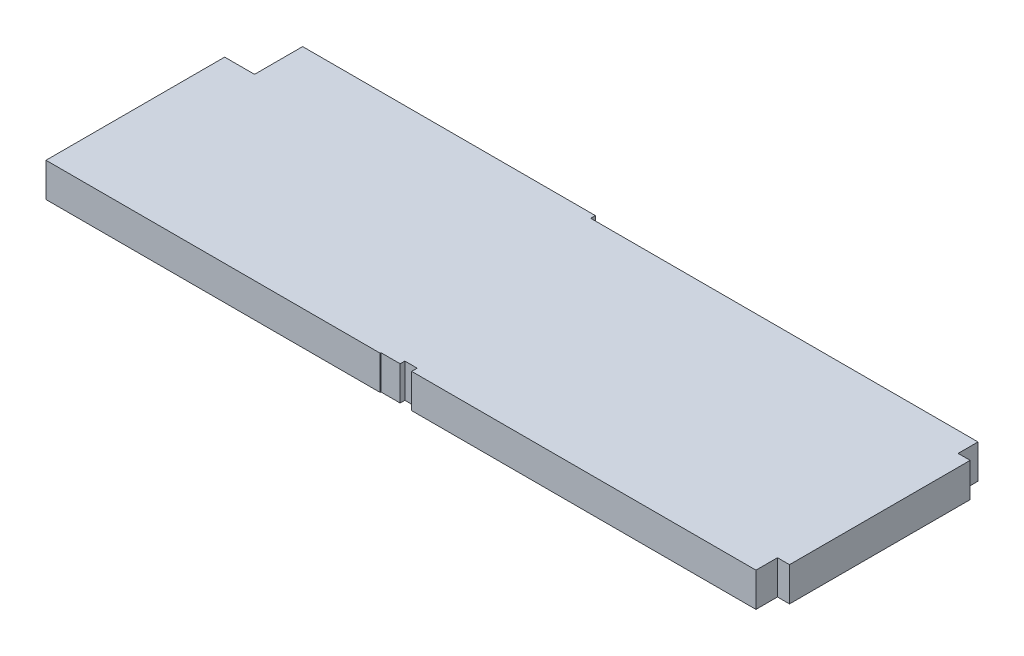
ISO-10303-21;
HEADER;
FILE_DESCRIPTION(('STEP AP214'),'2;1');
FILE_NAME('part.step','',(''),(''),'','','');
FILE_SCHEMA(('AUTOMOTIVE_DESIGN { 1 0 10303 214 1 1 1 1 }'));
ENDSEC;
DATA;
#1=APPLICATION_CONTEXT('core data for automotive mechanical design processes');
#2=APPLICATION_PROTOCOL_DEFINITION('international standard','automotive_design',2000,#1);
#3=PRODUCT_CONTEXT('',#1,'mechanical');
#4=PRODUCT('Part','Part','',(#3));
#5=PRODUCT_RELATED_PRODUCT_CATEGORY('part','',(#4));
#6=PRODUCT_DEFINITION_FORMATION('','',#4);
#7=PRODUCT_DEFINITION_CONTEXT('part definition',#1,'design');
#8=PRODUCT_DEFINITION('design','',#6,#7);
#9=PRODUCT_DEFINITION_SHAPE('','',#8);
#10=(LENGTH_UNIT() NAMED_UNIT(*) SI_UNIT(.MILLI.,.METRE.));
#11=(NAMED_UNIT(*) PLANE_ANGLE_UNIT() SI_UNIT($,.RADIAN.));
#12=(NAMED_UNIT(*) SI_UNIT($,.STERADIAN.) SOLID_ANGLE_UNIT());
#13=UNCERTAINTY_MEASURE_WITH_UNIT(LENGTH_MEASURE(1.E-05),#10,'distance_accuracy_value','');
#14=(GEOMETRIC_REPRESENTATION_CONTEXT(3) GLOBAL_UNCERTAINTY_ASSIGNED_CONTEXT((#13)) GLOBAL_UNIT_ASSIGNED_CONTEXT((#10,
#11,#12)) REPRESENTATION_CONTEXT('',''));
#15=CARTESIAN_POINT('',(0.,0.,0.));
#16=DIRECTION('',(0.,0.,1.));
#17=DIRECTION('',(1.,0.,0.));
#18=AXIS2_PLACEMENT_3D('',#15,#16,#17);
#19=CARTESIAN_POINT('',(142.05,14.47,0.));
#20=DIRECTION('',(0.,0.,-1.));
#21=DIRECTION('',(-1.,0.,0.));
#22=AXIS2_PLACEMENT_3D('',#19,#20,#21);
#23=PLANE('',#22);
#24=DIRECTION('',(1.,0.,0.));
#25=VECTOR('',#24,1.);
#26=CARTESIAN_POINT('',(142.05,0.,0.));
#27=LINE('',#26,#25);
#28=CARTESIAN_POINT('',(0.,0.,0.));
#29=VERTEX_POINT('',#28);
#30=CARTESIAN_POINT('',(142.05,0.,0.));
#31=VERTEX_POINT('',#30);
#32=EDGE_CURVE('E190',#29,#31,#27,.T.);
#33=ORIENTED_EDGE('',*,*,#32,.T.);
#34=DIRECTION('',(0.,-1.,0.));
#35=VECTOR('',#34,1.);
#36=CARTESIAN_POINT('',(142.05,14.47,0.));
#37=LINE('',#36,#35);
#38=CARTESIAN_POINT('',(142.05,14.47,0.));
#39=VERTEX_POINT('',#38);
#40=EDGE_CURVE('E11',#39,#31,#37,.T.);
#41=ORIENTED_EDGE('',*,*,#40,.F.);
#42=DIRECTION('',(1.,0.,0.));
#43=VECTOR('',#42,1.);
#44=CARTESIAN_POINT('',(142.05,14.47,0.));
#45=LINE('',#44,#43);
#46=CARTESIAN_POINT('',(0.,14.47,0.));
#47=VERTEX_POINT('',#46);
#48=EDGE_CURVE('E224',#47,#39,#45,.T.);
#49=ORIENTED_EDGE('',*,*,#48,.F.);
#50=DIRECTION('',(0.,-1.,0.));
#51=VECTOR('',#50,1.);
#52=CARTESIAN_POINT('',(0.,14.47,0.));
#53=LINE('',#52,#51);
#54=EDGE_CURVE('E186',#47,#29,#53,.T.);
#55=ORIENTED_EDGE('',*,*,#54,.T.);
#56=EDGE_LOOP('',(#33,#41,#49,#55));
#57=FACE_BOUND('',#56,.T.);
#58=ADVANCED_FACE('F34',(#57),#23,.F.);
#59=CARTESIAN_POINT('',(142.05,14.47,-0.350000000000015));
#60=DIRECTION('',(-1.,0.,0.));
#61=DIRECTION('',(0.,0.,1.));
#62=AXIS2_PLACEMENT_3D('',#59,#60,#61);
#63=PLANE('',#62);
#64=DIRECTION('',(0.,0.,-1.));
#65=VECTOR('',#64,1.);
#66=CARTESIAN_POINT('',(142.05,0.,-0.350000000000015));
#67=LINE('',#66,#65);
#68=CARTESIAN_POINT('',(142.05,0.,-0.350000000000015));
#69=VERTEX_POINT('',#68);
#70=EDGE_CURVE('E193',#31,#69,#67,.T.);
#71=ORIENTED_EDGE('',*,*,#70,.T.);
#72=DIRECTION('',(0.,-1.,0.));
#73=VECTOR('',#72,1.);
#74=CARTESIAN_POINT('',(142.05,14.47,-0.350000000000015));
#75=LINE('',#74,#73);
#76=CARTESIAN_POINT('',(142.05,14.47,-0.350000000000015));
#77=VERTEX_POINT('',#76);
#78=EDGE_CURVE('E42',#77,#69,#75,.T.);
#79=ORIENTED_EDGE('',*,*,#78,.F.);
#80=DIRECTION('',(0.,0.,-1.));
#81=VECTOR('',#80,1.);
#82=CARTESIAN_POINT('',(142.05,14.47,-0.350000000000015));
#83=LINE('',#82,#81);
#84=EDGE_CURVE('E123',#39,#77,#83,.T.);
#85=ORIENTED_EDGE('',*,*,#84,.F.);
#86=ORIENTED_EDGE('',*,*,#40,.T.);
#87=EDGE_LOOP('',(#71,#79,#85,#86));
#88=FACE_BOUND('',#87,.T.);
#89=ADVANCED_FACE('F332',(#88),#63,.F.);
#90=CARTESIAN_POINT('',(150.2,14.47,-0.350000000000016));
#91=DIRECTION('',(0.,0.,-1.));
#92=DIRECTION('',(-1.,0.,0.));
#93=AXIS2_PLACEMENT_3D('',#90,#91,#92);
#94=PLANE('',#93);
#95=DIRECTION('',(1.,0.,0.));
#96=VECTOR('',#95,1.);
#97=CARTESIAN_POINT('',(150.2,0.,-0.350000000000016));
#98=LINE('',#97,#96);
#99=CARTESIAN_POINT('',(150.2,0.,-0.350000000000016));
#100=VERTEX_POINT('',#99);
#101=EDGE_CURVE('E195',#69,#100,#98,.T.);
#102=ORIENTED_EDGE('',*,*,#101,.T.);
#103=DIRECTION('',(0.,-1.,0.));
#104=VECTOR('',#103,1.);
#105=CARTESIAN_POINT('',(150.2,14.47,-0.350000000000016));
#106=LINE('',#105,#104);
#107=CARTESIAN_POINT('',(150.2,14.47,-0.350000000000016));
#108=VERTEX_POINT('',#107);
#109=EDGE_CURVE('E261',#108,#100,#106,.T.);
#110=ORIENTED_EDGE('',*,*,#109,.F.);
#111=DIRECTION('',(1.,0.,0.));
#112=VECTOR('',#111,1.);
#113=CARTESIAN_POINT('',(150.2,14.47,-0.350000000000016));
#114=LINE('',#113,#112);
#115=EDGE_CURVE('E269',#77,#108,#114,.T.);
#116=ORIENTED_EDGE('',*,*,#115,.F.);
#117=ORIENTED_EDGE('',*,*,#78,.T.);
#118=EDGE_LOOP('',(#102,#110,#116,#117));
#119=FACE_BOUND('',#118,.T.);
#120=ADVANCED_FACE('F267',(#119),#94,.F.);
#121=CARTESIAN_POINT('',(150.2,14.47,-2.35));
#122=DIRECTION('',(-1.,0.,0.));
#123=DIRECTION('',(0.,0.,1.));
#124=AXIS2_PLACEMENT_3D('',#121,#122,#123);
#125=PLANE('',#124);
#126=DIRECTION('',(0.,0.,-1.));
#127=VECTOR('',#126,1.);
#128=CARTESIAN_POINT('',(150.2,0.,-2.35));
#129=LINE('',#128,#127);
#130=CARTESIAN_POINT('',(150.2,0.,-2.35));
#131=VERTEX_POINT('',#130);
#132=EDGE_CURVE('E197',#100,#131,#129,.T.);
#133=ORIENTED_EDGE('',*,*,#132,.T.);
#134=DIRECTION('',(0.,-1.,0.));
#135=VECTOR('',#134,1.);
#136=CARTESIAN_POINT('',(150.2,14.47,-2.35));
#137=LINE('',#136,#135);
#138=CARTESIAN_POINT('',(150.2,14.47,-2.35));
#139=VERTEX_POINT('',#138);
#140=EDGE_CURVE('E258',#139,#131,#137,.T.);
#141=ORIENTED_EDGE('',*,*,#140,.F.);
#142=DIRECTION('',(0.,0.,-1.));
#143=VECTOR('',#142,1.);
#144=CARTESIAN_POINT('',(150.2,14.47,-2.35));
#145=LINE('',#144,#143);
#146=EDGE_CURVE('E287',#108,#139,#145,.T.);
#147=ORIENTED_EDGE('',*,*,#146,.F.);
#148=ORIENTED_EDGE('',*,*,#109,.T.);
#149=EDGE_LOOP('',(#133,#141,#147,#148));
#150=FACE_BOUND('',#149,.T.);
#151=ADVANCED_FACE('F278',(#150),#125,.F.);
#152=CARTESIAN_POINT('',(155.45,14.47,-2.35));
#153=DIRECTION('',(0.,0.,-1.));
#154=DIRECTION('',(-1.,0.,0.));
#155=AXIS2_PLACEMENT_3D('',#152,#153,#154);
#156=PLANE('',#155);
#157=DIRECTION('',(1.,0.,0.));
#158=VECTOR('',#157,1.);
#159=CARTESIAN_POINT('',(155.45,0.,-2.35));
#160=LINE('',#159,#158);
#161=CARTESIAN_POINT('',(155.45,0.,-2.35));
#162=VERTEX_POINT('',#161);
#163=EDGE_CURVE('E199',#131,#162,#160,.T.);
#164=ORIENTED_EDGE('',*,*,#163,.T.);
#165=DIRECTION('',(0.,-1.,0.));
#166=VECTOR('',#165,1.);
#167=CARTESIAN_POINT('',(155.45,14.47,-2.35));
#168=LINE('',#167,#166);
#169=CARTESIAN_POINT('',(155.45,14.47,-2.35));
#170=VERTEX_POINT('',#169);
#171=EDGE_CURVE('E255',#170,#162,#168,.T.);
#172=ORIENTED_EDGE('',*,*,#171,.F.);
#173=DIRECTION('',(1.,0.,0.));
#174=VECTOR('',#173,1.);
#175=CARTESIAN_POINT('',(155.45,14.47,-2.35));
#176=LINE('',#175,#174);
#177=EDGE_CURVE('E284',#139,#170,#176,.T.);
#178=ORIENTED_EDGE('',*,*,#177,.F.);
#179=ORIENTED_EDGE('',*,*,#140,.T.);
#180=EDGE_LOOP('',(#164,#172,#178,#179));
#181=FACE_BOUND('',#180,.T.);
#182=ADVANCED_FACE('F282',(#181),#156,.F.);
#183=CARTESIAN_POINT('',(155.45,14.47,0.));
#184=DIRECTION('',(1.,0.,0.));
#185=DIRECTION('',(0.,0.,-1.));
#186=AXIS2_PLACEMENT_3D('',#183,#184,#185);
#187=PLANE('',#186);
#188=DIRECTION('',(0.,0.,1.));
#189=VECTOR('',#188,1.);
#190=CARTESIAN_POINT('',(155.45,0.,0.));
#191=LINE('',#190,#189);
#192=CARTESIAN_POINT('',(155.45,0.,0.));
#193=VERTEX_POINT('',#192);
#194=EDGE_CURVE('E201',#162,#193,#191,.T.);
#195=ORIENTED_EDGE('',*,*,#194,.T.);
#196=DIRECTION('',(0.,-1.,0.));
#197=VECTOR('',#196,1.);
#198=CARTESIAN_POINT('',(155.45,14.47,0.));
#199=LINE('',#198,#197);
#200=CARTESIAN_POINT('',(155.45,14.47,0.));
#201=VERTEX_POINT('',#200);
#202=EDGE_CURVE('E252',#201,#193,#199,.T.);
#203=ORIENTED_EDGE('',*,*,#202,.F.);
#204=DIRECTION('',(0.,0.,1.));
#205=VECTOR('',#204,1.);
#206=CARTESIAN_POINT('',(155.45,14.47,0.));
#207=LINE('',#206,#205);
#208=EDGE_CURVE('E286',#170,#201,#207,.T.);
#209=ORIENTED_EDGE('',*,*,#208,.F.);
#210=ORIENTED_EDGE('',*,*,#171,.T.);
#211=EDGE_LOOP('',(#195,#203,#209,#210));
#212=FACE_BOUND('',#211,.T.);
#213=ADVANCED_FACE('F345',(#212),#187,.F.);
#214=CARTESIAN_POINT('',(301.8,14.47,0.));
#215=DIRECTION('',(0.,0.,-1.));
#216=DIRECTION('',(-1.,0.,0.));
#217=AXIS2_PLACEMENT_3D('',#214,#215,#216);
#218=PLANE('',#217);
#219=DIRECTION('',(1.,0.,0.));
#220=VECTOR('',#219,1.);
#221=CARTESIAN_POINT('',(301.8,0.,0.));
#222=LINE('',#221,#220);
#223=CARTESIAN_POINT('',(301.8,0.,0.));
#224=VERTEX_POINT('',#223);
#225=EDGE_CURVE('E203',#193,#224,#222,.T.);
#226=ORIENTED_EDGE('',*,*,#225,.T.);
#227=DIRECTION('',(0.,-1.,0.));
#228=VECTOR('',#227,1.);
#229=CARTESIAN_POINT('',(301.8,14.47,0.));
#230=LINE('',#229,#228);
#231=CARTESIAN_POINT('',(301.8,14.47,0.));
#232=VERTEX_POINT('',#231);
#233=EDGE_CURVE('E249',#232,#224,#230,.T.);
#234=ORIENTED_EDGE('',*,*,#233,.F.);
#235=DIRECTION('',(1.,0.,0.));
#236=VECTOR('',#235,1.);
#237=CARTESIAN_POINT('',(301.8,14.47,0.));
#238=LINE('',#237,#236);
#239=EDGE_CURVE('E289',#201,#232,#238,.T.);
#240=ORIENTED_EDGE('',*,*,#239,.F.);
#241=ORIENTED_EDGE('',*,*,#202,.T.);
#242=EDGE_LOOP('',(#226,#234,#240,#241));
#243=FACE_BOUND('',#242,.T.);
#244=ADVANCED_FACE('F348',(#243),#218,.F.);
#245=CARTESIAN_POINT('',(301.8,14.47,-9.15));
#246=DIRECTION('',(-1.,0.,0.));
#247=DIRECTION('',(0.,0.,1.));
#248=AXIS2_PLACEMENT_3D('',#245,#246,#247);
#249=PLANE('',#248);
#250=DIRECTION('',(0.,0.,-1.));
#251=VECTOR('',#250,1.);
#252=CARTESIAN_POINT('',(301.8,0.,-9.15));
#253=LINE('',#252,#251);
#254=CARTESIAN_POINT('',(301.8,0.,-9.15));
#255=VERTEX_POINT('',#254);
#256=EDGE_CURVE('E205',#224,#255,#253,.T.);
#257=ORIENTED_EDGE('',*,*,#256,.T.);
#258=DIRECTION('',(0.,-1.,0.));
#259=VECTOR('',#258,1.);
#260=CARTESIAN_POINT('',(301.8,14.47,-9.15));
#261=LINE('',#260,#259);
#262=CARTESIAN_POINT('',(301.8,14.47,-9.15));
#263=VERTEX_POINT('',#262);
#264=EDGE_CURVE('E246',#263,#255,#261,.T.);
#265=ORIENTED_EDGE('',*,*,#264,.F.);
#266=DIRECTION('',(0.,0.,-1.));
#267=VECTOR('',#266,1.);
#268=CARTESIAN_POINT('',(301.8,14.47,-9.15));
#269=LINE('',#268,#267);
#270=EDGE_CURVE('E295',#232,#263,#269,.T.);
#271=ORIENTED_EDGE('',*,*,#270,.F.);
#272=ORIENTED_EDGE('',*,*,#233,.T.);
#273=EDGE_LOOP('',(#257,#265,#271,#272));
#274=FACE_BOUND('',#273,.T.);
#275=ADVANCED_FACE('F352',(#274),#249,.F.);
#276=CARTESIAN_POINT('',(306.92,14.47,-9.15));
#277=DIRECTION('',(0.,0.,-1.));
#278=DIRECTION('',(-1.,0.,0.));
#279=AXIS2_PLACEMENT_3D('',#276,#277,#278);
#280=PLANE('',#279);
#281=DIRECTION('',(1.,0.,0.));
#282=VECTOR('',#281,1.);
#283=CARTESIAN_POINT('',(306.92,0.,-9.15));
#284=LINE('',#283,#282);
#285=CARTESIAN_POINT('',(306.92,0.,-9.15));
#286=VERTEX_POINT('',#285);
#287=EDGE_CURVE('E207',#255,#286,#284,.T.);
#288=ORIENTED_EDGE('',*,*,#287,.T.);
#289=DIRECTION('',(0.,-1.,0.));
#290=VECTOR('',#289,1.);
#291=CARTESIAN_POINT('',(306.92,14.47,-9.15));
#292=LINE('',#291,#290);
#293=CARTESIAN_POINT('',(306.92,14.47,-9.15));
#294=VERTEX_POINT('',#293);
#295=EDGE_CURVE('E243',#294,#286,#292,.T.);
#296=ORIENTED_EDGE('',*,*,#295,.F.);
#297=DIRECTION('',(1.,0.,0.));
#298=VECTOR('',#297,1.);
#299=CARTESIAN_POINT('',(306.92,14.47,-9.15));
#300=LINE('',#299,#298);
#301=EDGE_CURVE('E297',#263,#294,#300,.T.);
#302=ORIENTED_EDGE('',*,*,#301,.F.);
#303=ORIENTED_EDGE('',*,*,#264,.T.);
#304=EDGE_LOOP('',(#288,#296,#302,#303));
#305=FACE_BOUND('',#304,.T.);
#306=ADVANCED_FACE('F356',(#305),#280,.F.);
#307=CARTESIAN_POINT('',(306.92,14.47,-9.15));
#308=DIRECTION('',(-1.,0.,0.));
#309=DIRECTION('',(0.,0.,1.));
#310=AXIS2_PLACEMENT_3D('',#307,#308,#309);
#311=PLANE('',#310);
#312=DIRECTION('',(0.,0.,-1.));
#313=VECTOR('',#312,1.);
#314=CARTESIAN_POINT('',(306.92,0.,-9.15));
#315=LINE('',#314,#313);
#316=CARTESIAN_POINT('',(306.92,0.,-85.95));
#317=VERTEX_POINT('',#316);
#318=EDGE_CURVE('E209',#286,#317,#315,.T.);
#319=ORIENTED_EDGE('',*,*,#318,.T.);
#320=DIRECTION('',(0.,-1.,0.));
#321=VECTOR('',#320,1.);
#322=CARTESIAN_POINT('',(306.92,14.47,-85.95));
#323=LINE('',#322,#321);
#324=CARTESIAN_POINT('',(306.92,14.47,-85.95));
#325=VERTEX_POINT('',#324);
#326=EDGE_CURVE('E240',#325,#317,#323,.T.);
#327=ORIENTED_EDGE('',*,*,#326,.F.);
#328=DIRECTION('',(0.,0.,-1.));
#329=VECTOR('',#328,1.);
#330=CARTESIAN_POINT('',(306.92,14.47,-9.15));
#331=LINE('',#330,#329);
#332=EDGE_CURVE('E299',#294,#325,#331,.T.);
#333=ORIENTED_EDGE('',*,*,#332,.F.);
#334=ORIENTED_EDGE('',*,*,#295,.T.);
#335=EDGE_LOOP('',(#319,#327,#333,#334));
#336=FACE_BOUND('',#335,.T.);
#337=ADVANCED_FACE('F360',(#336),#311,.F.);
#338=CARTESIAN_POINT('',(301.8,14.47,-85.95));
#339=DIRECTION('',(0.,0.,1.));
#340=DIRECTION('',(1.,0.,0.));
#341=AXIS2_PLACEMENT_3D('',#338,#339,#340);
#342=PLANE('',#341);
#343=DIRECTION('',(-1.,0.,0.));
#344=VECTOR('',#343,1.);
#345=CARTESIAN_POINT('',(301.8,0.,-85.95));
#346=LINE('',#345,#344);
#347=CARTESIAN_POINT('',(301.8,0.,-85.95));
#348=VERTEX_POINT('',#347);
#349=EDGE_CURVE('E211',#317,#348,#346,.T.);
#350=ORIENTED_EDGE('',*,*,#349,.T.);
#351=DIRECTION('',(0.,-1.,0.));
#352=VECTOR('',#351,1.);
#353=CARTESIAN_POINT('',(301.8,14.47,-85.95));
#354=LINE('',#353,#352);
#355=CARTESIAN_POINT('',(301.8,14.47,-85.95));
#356=VERTEX_POINT('',#355);
#357=EDGE_CURVE('E237',#356,#348,#354,.T.);
#358=ORIENTED_EDGE('',*,*,#357,.F.);
#359=DIRECTION('',(-1.,0.,0.));
#360=VECTOR('',#359,1.);
#361=CARTESIAN_POINT('',(301.8,14.47,-85.95));
#362=LINE('',#361,#360);
#363=EDGE_CURVE('E301',#325,#356,#362,.T.);
#364=ORIENTED_EDGE('',*,*,#363,.F.);
#365=ORIENTED_EDGE('',*,*,#326,.T.);
#366=EDGE_LOOP('',(#350,#358,#364,#365));
#367=FACE_BOUND('',#366,.T.);
#368=ADVANCED_FACE('F364',(#367),#342,.F.);
#369=CARTESIAN_POINT('',(301.8,14.47,-94.4));
#370=DIRECTION('',(-1.,0.,0.));
#371=DIRECTION('',(0.,0.,1.));
#372=AXIS2_PLACEMENT_3D('',#369,#370,#371);
#373=PLANE('',#372);
#374=DIRECTION('',(0.,0.,-1.));
#375=VECTOR('',#374,1.);
#376=CARTESIAN_POINT('',(301.8,0.,-94.4));
#377=LINE('',#376,#375);
#378=CARTESIAN_POINT('',(301.8,0.,-94.4));
#379=VERTEX_POINT('',#378);
#380=EDGE_CURVE('E213',#348,#379,#377,.T.);
#381=ORIENTED_EDGE('',*,*,#380,.T.);
#382=DIRECTION('',(0.,-1.,0.));
#383=VECTOR('',#382,1.);
#384=CARTESIAN_POINT('',(301.8,14.47,-94.4));
#385=LINE('',#384,#383);
#386=CARTESIAN_POINT('',(301.8,14.47,-94.4));
#387=VERTEX_POINT('',#386);
#388=EDGE_CURVE('E234',#387,#379,#385,.T.);
#389=ORIENTED_EDGE('',*,*,#388,.F.);
#390=DIRECTION('',(0.,0.,-1.));
#391=VECTOR('',#390,1.);
#392=CARTESIAN_POINT('',(301.8,14.47,-94.4));
#393=LINE('',#392,#391);
#394=EDGE_CURVE('E303',#356,#387,#393,.T.);
#395=ORIENTED_EDGE('',*,*,#394,.F.);
#396=ORIENTED_EDGE('',*,*,#357,.T.);
#397=EDGE_LOOP('',(#381,#389,#395,#396));
#398=FACE_BOUND('',#397,.T.);
#399=ADVANCED_FACE('F368',(#398),#373,.F.);
#400=CARTESIAN_POINT('',(137.15,14.47,-94.4));
#401=DIRECTION('',(0.,0.,1.));
#402=DIRECTION('',(1.,0.,0.));
#403=AXIS2_PLACEMENT_3D('',#400,#401,#402);
#404=PLANE('',#403);
#405=DIRECTION('',(-1.,0.,0.));
#406=VECTOR('',#405,1.);
#407=CARTESIAN_POINT('',(137.15,0.,-94.4));
#408=LINE('',#407,#406);
#409=CARTESIAN_POINT('',(137.15,0.,-94.4));
#410=VERTEX_POINT('',#409);
#411=EDGE_CURVE('E215',#379,#410,#408,.T.);
#412=ORIENTED_EDGE('',*,*,#411,.T.);
#413=DIRECTION('',(0.,-1.,0.));
#414=VECTOR('',#413,1.);
#415=CARTESIAN_POINT('',(137.15,14.47,-94.4));
#416=LINE('',#415,#414);
#417=CARTESIAN_POINT('',(137.15,14.47,-94.4));
#418=VERTEX_POINT('',#417);
#419=EDGE_CURVE('E231',#418,#410,#416,.T.);
#420=ORIENTED_EDGE('',*,*,#419,.F.);
#421=DIRECTION('',(-1.,0.,0.));
#422=VECTOR('',#421,1.);
#423=CARTESIAN_POINT('',(137.15,14.47,-94.4));
#424=LINE('',#423,#422);
#425=EDGE_CURVE('E305',#387,#418,#424,.T.);
#426=ORIENTED_EDGE('',*,*,#425,.F.);
#427=ORIENTED_EDGE('',*,*,#388,.T.);
#428=EDGE_LOOP('',(#412,#420,#426,#427));
#429=FACE_BOUND('',#428,.T.);
#430=ADVANCED_FACE('F372',(#429),#404,.F.);
#431=CARTESIAN_POINT('',(137.15,14.47,-96.4));
#432=DIRECTION('',(-1.,0.,0.));
#433=DIRECTION('',(0.,0.,1.));
#434=AXIS2_PLACEMENT_3D('',#431,#432,#433);
#435=PLANE('',#434);
#436=DIRECTION('',(0.,0.,-1.));
#437=VECTOR('',#436,1.);
#438=CARTESIAN_POINT('',(137.15,0.,-96.4));
#439=LINE('',#438,#437);
#440=CARTESIAN_POINT('',(137.15,0.,-96.4));
#441=VERTEX_POINT('',#440);
#442=EDGE_CURVE('E217',#410,#441,#439,.T.);
#443=ORIENTED_EDGE('',*,*,#442,.T.);
#444=DIRECTION('',(0.,-1.,0.));
#445=VECTOR('',#444,1.);
#446=CARTESIAN_POINT('',(137.15,14.47,-96.4));
#447=LINE('',#446,#445);
#448=CARTESIAN_POINT('',(137.15,14.47,-96.4));
#449=VERTEX_POINT('',#448);
#450=EDGE_CURVE('E228',#449,#441,#447,.T.);
#451=ORIENTED_EDGE('',*,*,#450,.F.);
#452=DIRECTION('',(0.,0.,-1.));
#453=VECTOR('',#452,1.);
#454=CARTESIAN_POINT('',(137.15,14.47,-96.4));
#455=LINE('',#454,#453);
#456=EDGE_CURVE('E307',#418,#449,#455,.T.);
#457=ORIENTED_EDGE('',*,*,#456,.F.);
#458=ORIENTED_EDGE('',*,*,#419,.T.);
#459=EDGE_LOOP('',(#443,#451,#457,#458));
#460=FACE_BOUND('',#459,.T.);
#461=ADVANCED_FACE('F313',(#460),#435,.F.);
#462=CARTESIAN_POINT('',(12.7,14.47,-96.4));
#463=DIRECTION('',(0.,0.,1.));
#464=DIRECTION('',(1.,0.,0.));
#465=AXIS2_PLACEMENT_3D('',#462,#463,#464);
#466=PLANE('',#465);
#467=DIRECTION('',(-1.,0.,0.));
#468=VECTOR('',#467,1.);
#469=CARTESIAN_POINT('',(12.7,0.,-96.4));
#470=LINE('',#469,#468);
#471=CARTESIAN_POINT('',(12.7,0.,-96.4));
#472=VERTEX_POINT('',#471);
#473=EDGE_CURVE('E219',#441,#472,#470,.T.);
#474=ORIENTED_EDGE('',*,*,#473,.T.);
#475=DIRECTION('',(0.,-1.,0.));
#476=VECTOR('',#475,1.);
#477=CARTESIAN_POINT('',(12.7,14.47,-96.4));
#478=LINE('',#477,#476);
#479=CARTESIAN_POINT('',(12.7,14.47,-96.4));
#480=VERTEX_POINT('',#479);
#481=EDGE_CURVE('E181',#480,#472,#478,.T.);
#482=ORIENTED_EDGE('',*,*,#481,.F.);
#483=DIRECTION('',(-1.,0.,0.));
#484=VECTOR('',#483,1.);
#485=CARTESIAN_POINT('',(12.7,14.47,-96.4));
#486=LINE('',#485,#484);
#487=EDGE_CURVE('E172',#449,#480,#486,.T.);
#488=ORIENTED_EDGE('',*,*,#487,.F.);
#489=ORIENTED_EDGE('',*,*,#450,.T.);
#490=EDGE_LOOP('',(#474,#482,#488,#489));
#491=FACE_BOUND('',#490,.T.);
#492=ADVANCED_FACE('F317',(#491),#466,.F.);
#493=CARTESIAN_POINT('',(12.7,14.47,-75.95));
#494=DIRECTION('',(1.,0.,0.));
#495=DIRECTION('',(0.,0.,-1.));
#496=AXIS2_PLACEMENT_3D('',#493,#494,#495);
#497=PLANE('',#496);
#498=DIRECTION('',(0.,0.,1.));
#499=VECTOR('',#498,1.);
#500=CARTESIAN_POINT('',(12.7,0.,-75.95));
#501=LINE('',#500,#499);
#502=CARTESIAN_POINT('',(12.7,0.,-75.95));
#503=VERTEX_POINT('',#502);
#504=EDGE_CURVE('E180',#472,#503,#501,.T.);
#505=ORIENTED_EDGE('',*,*,#504,.T.);
#506=DIRECTION('',(0.,-1.,0.));
#507=VECTOR('',#506,1.);
#508=CARTESIAN_POINT('',(12.7,14.47,-75.95));
#509=LINE('',#508,#507);
#510=CARTESIAN_POINT('',(12.7,14.47,-75.95));
#511=VERTEX_POINT('',#510);
#512=EDGE_CURVE('E177',#511,#503,#509,.T.);
#513=ORIENTED_EDGE('',*,*,#512,.F.);
#514=DIRECTION('',(0.,0.,1.));
#515=VECTOR('',#514,1.);
#516=CARTESIAN_POINT('',(12.7,14.47,-75.95));
#517=LINE('',#516,#515);
#518=EDGE_CURVE('E166',#480,#511,#517,.T.);
#519=ORIENTED_EDGE('',*,*,#518,.F.);
#520=ORIENTED_EDGE('',*,*,#481,.T.);
#521=EDGE_LOOP('',(#505,#513,#519,#520));
#522=FACE_BOUND('',#521,.T.);
#523=ADVANCED_FACE('F178',(#522),#497,.F.);
#524=CARTESIAN_POINT('',(0.,14.47,-75.95));
#525=DIRECTION('',(0.,0.,1.));
#526=DIRECTION('',(1.,0.,0.));
#527=AXIS2_PLACEMENT_3D('',#524,#525,#526);
#528=PLANE('',#527);
#529=DIRECTION('',(-1.,0.,0.));
#530=VECTOR('',#529,1.);
#531=CARTESIAN_POINT('',(0.,0.,-75.95));
#532=LINE('',#531,#530);
#533=CARTESIAN_POINT('',(0.,0.,-75.95));
#534=VERTEX_POINT('',#533);
#535=EDGE_CURVE('E109',#503,#534,#532,.T.);
#536=ORIENTED_EDGE('',*,*,#535,.T.);
#537=DIRECTION('',(0.,-1.,0.));
#538=VECTOR('',#537,1.);
#539=CARTESIAN_POINT('',(0.,14.47,-75.95));
#540=LINE('',#539,#538);
#541=CARTESIAN_POINT('',(0.,14.47,-75.95));
#542=VERTEX_POINT('',#541);
#543=EDGE_CURVE('E182',#542,#534,#540,.T.);
#544=ORIENTED_EDGE('',*,*,#543,.F.);
#545=DIRECTION('',(-1.,0.,0.));
#546=VECTOR('',#545,1.);
#547=CARTESIAN_POINT('',(0.,14.47,-75.95));
#548=LINE('',#547,#546);
#549=EDGE_CURVE('E170',#511,#542,#548,.T.);
#550=ORIENTED_EDGE('',*,*,#549,.F.);
#551=ORIENTED_EDGE('',*,*,#512,.T.);
#552=EDGE_LOOP('',(#536,#544,#550,#551));
#553=FACE_BOUND('',#552,.T.);
#554=ADVANCED_FACE('F184',(#553),#528,.F.);
#555=CARTESIAN_POINT('',(0.,14.47,0.));
#556=DIRECTION('',(1.,0.,0.));
#557=DIRECTION('',(0.,0.,-1.));
#558=AXIS2_PLACEMENT_3D('',#555,#556,#557);
#559=PLANE('',#558);
#560=DIRECTION('',(0.,0.,1.));
#561=VECTOR('',#560,1.);
#562=CARTESIAN_POINT('',(0.,0.,0.));
#563=LINE('',#562,#561);
#564=EDGE_CURVE('E115',#534,#29,#563,.T.);
#565=ORIENTED_EDGE('',*,*,#564,.T.);
#566=ORIENTED_EDGE('',*,*,#54,.F.);
#567=DIRECTION('',(0.,0.,1.));
#568=VECTOR('',#567,1.);
#569=CARTESIAN_POINT('',(0.,14.47,0.));
#570=LINE('',#569,#568);
#571=EDGE_CURVE('E50',#542,#47,#570,.T.);
#572=ORIENTED_EDGE('',*,*,#571,.F.);
#573=ORIENTED_EDGE('',*,*,#543,.T.);
#574=EDGE_LOOP('',(#565,#566,#572,#573));
#575=FACE_BOUND('',#574,.T.);
#576=ADVANCED_FACE('F321',(#575),#559,.F.);
#577=CARTESIAN_POINT('',(0.,14.47,0.));
#578=DIRECTION('',(0.,-1.,0.));
#579=DIRECTION('',(0.,0.,-1.));
#580=AXIS2_PLACEMENT_3D('',#577,#578,#579);
#581=PLANE('',#580);
#582=ORIENTED_EDGE('',*,*,#48,.T.);
#583=ORIENTED_EDGE('',*,*,#84,.T.);
#584=ORIENTED_EDGE('',*,*,#115,.T.);
#585=ORIENTED_EDGE('',*,*,#146,.T.);
#586=ORIENTED_EDGE('',*,*,#177,.T.);
#587=ORIENTED_EDGE('',*,*,#208,.T.);
#588=ORIENTED_EDGE('',*,*,#239,.T.);
#589=ORIENTED_EDGE('',*,*,#270,.T.);
#590=ORIENTED_EDGE('',*,*,#301,.T.);
#591=ORIENTED_EDGE('',*,*,#332,.T.);
#592=ORIENTED_EDGE('',*,*,#363,.T.);
#593=ORIENTED_EDGE('',*,*,#394,.T.);
#594=ORIENTED_EDGE('',*,*,#425,.T.);
#595=ORIENTED_EDGE('',*,*,#456,.T.);
#596=ORIENTED_EDGE('',*,*,#487,.T.);
#597=ORIENTED_EDGE('',*,*,#518,.T.);
#598=ORIENTED_EDGE('',*,*,#549,.T.);
#599=ORIENTED_EDGE('',*,*,#571,.T.);
#600=EDGE_LOOP('',(#582,#583,#584,#585,#586,#587,#588,#589,#590,#591,#592,#593,#594,#595,#596,
#597,#598,#599));
#601=FACE_BOUND('',#600,.T.);
#602=ADVANCED_FACE('F168',(#601),#581,.F.);
#603=CARTESIAN_POINT('',(0.,0.,0.));
#604=DIRECTION('',(0.,-1.,0.));
#605=DIRECTION('',(0.,0.,-1.));
#606=AXIS2_PLACEMENT_3D('',#603,#604,#605);
#607=PLANE('',#606);
#608=ORIENTED_EDGE('',*,*,#32,.F.);
#609=ORIENTED_EDGE('',*,*,#564,.F.);
#610=ORIENTED_EDGE('',*,*,#535,.F.);
#611=ORIENTED_EDGE('',*,*,#504,.F.);
#612=ORIENTED_EDGE('',*,*,#473,.F.);
#613=ORIENTED_EDGE('',*,*,#442,.F.);
#614=ORIENTED_EDGE('',*,*,#411,.F.);
#615=ORIENTED_EDGE('',*,*,#380,.F.);
#616=ORIENTED_EDGE('',*,*,#349,.F.);
#617=ORIENTED_EDGE('',*,*,#318,.F.);
#618=ORIENTED_EDGE('',*,*,#287,.F.);
#619=ORIENTED_EDGE('',*,*,#256,.F.);
#620=ORIENTED_EDGE('',*,*,#225,.F.);
#621=ORIENTED_EDGE('',*,*,#194,.F.);
#622=ORIENTED_EDGE('',*,*,#163,.F.);
#623=ORIENTED_EDGE('',*,*,#132,.F.);
#624=ORIENTED_EDGE('',*,*,#101,.F.);
#625=ORIENTED_EDGE('',*,*,#70,.F.);
#626=EDGE_LOOP('',(#608,#609,#610,#611,#612,#613,#614,#615,#616,#617,#618,#619,#620,#621,#622,
#623,#624,#625));
#627=FACE_BOUND('',#626,.T.);
#628=ADVANCED_FACE('F273',(#627),#607,.T.);
#629=CLOSED_SHELL('',(#58,#89,#120,#151,#182,#213,#244,#275,#306,#337,#368,#399,#430,#461,#492,
#523,#554,#576,#602,#628));
#630=MANIFOLD_SOLID_BREP('B2',#629);
#631=ADVANCED_BREP_SHAPE_REPRESENTATION('',(#18,#630),#14);
#632=SHAPE_DEFINITION_REPRESENTATION(#9,#631);
ENDSEC;
END-ISO-10303-21;
